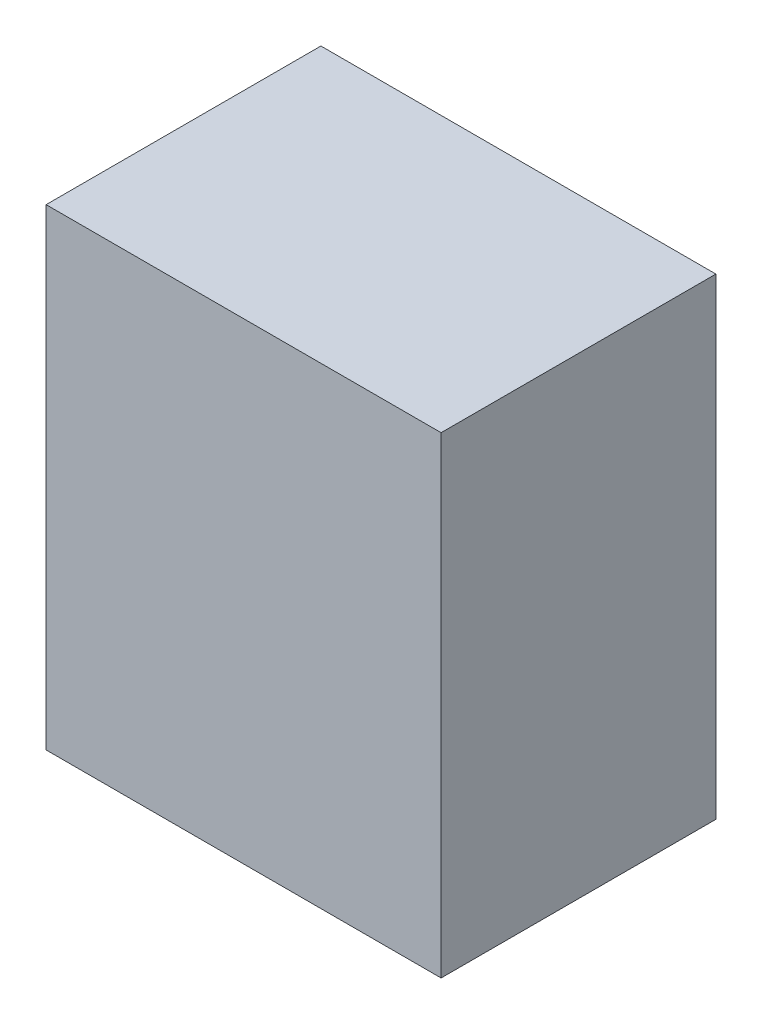
ISO-10303-21;
HEADER;
FILE_DESCRIPTION(('STEP AP214'),'2;1');
FILE_NAME('part.step','',(''),(''),'','','');
FILE_SCHEMA(('AUTOMOTIVE_DESIGN { 1 0 10303 214 1 1 1 1 }'));
ENDSEC;
DATA;
#1=APPLICATION_CONTEXT('core data for automotive mechanical design processes');
#2=APPLICATION_PROTOCOL_DEFINITION('international standard','automotive_design',2000,#1);
#3=PRODUCT_CONTEXT('',#1,'mechanical');
#4=PRODUCT('Part','Part','',(#3));
#5=PRODUCT_RELATED_PRODUCT_CATEGORY('part','',(#4));
#6=PRODUCT_DEFINITION_FORMATION('','',#4);
#7=PRODUCT_DEFINITION_CONTEXT('part definition',#1,'design');
#8=PRODUCT_DEFINITION('design','',#6,#7);
#9=PRODUCT_DEFINITION_SHAPE('','',#8);
#10=(LENGTH_UNIT() NAMED_UNIT(*) SI_UNIT(.MILLI.,.METRE.));
#11=(NAMED_UNIT(*) PLANE_ANGLE_UNIT() SI_UNIT($,.RADIAN.));
#12=(NAMED_UNIT(*) SI_UNIT($,.STERADIAN.) SOLID_ANGLE_UNIT());
#13=UNCERTAINTY_MEASURE_WITH_UNIT(LENGTH_MEASURE(1.E-05),#10,'distance_accuracy_value','');
#14=(GEOMETRIC_REPRESENTATION_CONTEXT(3) GLOBAL_UNCERTAINTY_ASSIGNED_CONTEXT((#13)) GLOBAL_UNIT_ASSIGNED_CONTEXT((#10,
#11,#12)) REPRESENTATION_CONTEXT('',''));
#15=CARTESIAN_POINT('',(0.,0.,0.));
#16=DIRECTION('',(0.,0.,1.));
#17=DIRECTION('',(1.,0.,0.));
#18=AXIS2_PLACEMENT_3D('',#15,#16,#17);
#19=CARTESIAN_POINT('',(-0.57500012,-0.68749926,0.80000094));
#20=DIRECTION('',(0.,0.,-1.));
#21=DIRECTION('',(-1.,0.,0.));
#22=AXIS2_PLACEMENT_3D('',#19,#20,#21);
#23=PLANE('',#22);
#24=DIRECTION('',(0.,1.,0.));
#25=VECTOR('',#24,1.);
#26=CARTESIAN_POINT('',(0.57500012,-0.68749926,0.80000094));
#27=LINE('',#26,#25);
#28=CARTESIAN_POINT('',(0.57500012,-0.68749926,0.80000094));
#29=VERTEX_POINT('',#28);
#30=CARTESIAN_POINT('',(0.57500012,0.6875018,0.80000094));
#31=VERTEX_POINT('',#30);
#32=EDGE_CURVE('E55',#29,#31,#27,.T.);
#33=ORIENTED_EDGE('',*,*,#32,.T.);
#34=DIRECTION('',(1.,0.,0.));
#35=VECTOR('',#34,1.);
#36=CARTESIAN_POINT('',(0.57500012,0.6875018,0.80000094));
#37=LINE('',#36,#35);
#38=CARTESIAN_POINT('',(-0.57500012,0.6875018,0.80000094));
#39=VERTEX_POINT('',#38);
#40=EDGE_CURVE('E57',#31,#39,#37,.F.);
#41=ORIENTED_EDGE('',*,*,#40,.T.);
#42=DIRECTION('',(0.,1.,0.));
#43=VECTOR('',#42,1.);
#44=CARTESIAN_POINT('',(-0.57500012,0.6875018,0.80000094));
#45=LINE('',#44,#43);
#46=CARTESIAN_POINT('',(-0.57500012,-0.68749926,0.80000094));
#47=VERTEX_POINT('',#46);
#48=EDGE_CURVE('E20',#39,#47,#45,.F.);
#49=ORIENTED_EDGE('',*,*,#48,.T.);
#50=DIRECTION('',(1.,0.,0.));
#51=VECTOR('',#50,1.);
#52=CARTESIAN_POINT('',(-0.57500012,-0.68749926,0.80000094));
#53=LINE('',#52,#51);
#54=EDGE_CURVE('E80',#47,#29,#53,.T.);
#55=ORIENTED_EDGE('',*,*,#54,.T.);
#56=EDGE_LOOP('',(#33,#41,#49,#55));
#57=FACE_BOUND('',#56,.T.);
#58=ADVANCED_FACE('F17',(#57),#23,.F.);
#59=CARTESIAN_POINT('',(-0.57500012,0.6875018,0.));
#60=DIRECTION('',(1.,0.,0.));
#61=DIRECTION('',(0.,0.,-1.));
#62=AXIS2_PLACEMENT_3D('',#59,#60,#61);
#63=PLANE('',#62);
#64=DIRECTION('',(0.,0.,1.));
#65=VECTOR('',#64,1.);
#66=CARTESIAN_POINT('',(-0.57500012,-0.68749926,0.));
#67=LINE('',#66,#65);
#68=CARTESIAN_POINT('',(-0.57500012,-0.68749926,0.));
#69=VERTEX_POINT('',#68);
#70=EDGE_CURVE('E68',#69,#47,#67,.T.);
#71=ORIENTED_EDGE('',*,*,#70,.T.);
#72=ORIENTED_EDGE('',*,*,#48,.F.);
#73=DIRECTION('',(0.,0.,-1.));
#74=VECTOR('',#73,1.);
#75=CARTESIAN_POINT('',(-0.57500012,0.6875018,0.));
#76=LINE('',#75,#74);
#77=CARTESIAN_POINT('',(-0.57500012,0.6875018,0.));
#78=VERTEX_POINT('',#77);
#79=EDGE_CURVE('E63',#39,#78,#76,.T.);
#80=ORIENTED_EDGE('',*,*,#79,.T.);
#81=DIRECTION('',(0.,1.,0.));
#82=VECTOR('',#81,1.);
#83=CARTESIAN_POINT('',(-0.57500012,-0.68749926,0.));
#84=LINE('',#83,#82);
#85=EDGE_CURVE('E83',#69,#78,#84,.T.);
#86=ORIENTED_EDGE('',*,*,#85,.F.);
#87=EDGE_LOOP('',(#71,#72,#80,#86));
#88=FACE_BOUND('',#87,.T.);
#89=ADVANCED_FACE('F65',(#88),#63,.F.);
#90=CARTESIAN_POINT('',(0.57500012,0.6875018,0.));
#91=DIRECTION('',(0.,-1.,0.));
#92=DIRECTION('',(0.,0.,-1.));
#93=AXIS2_PLACEMENT_3D('',#90,#91,#92);
#94=PLANE('',#93);
#95=ORIENTED_EDGE('',*,*,#79,.F.);
#96=ORIENTED_EDGE('',*,*,#40,.F.);
#97=DIRECTION('',(0.,0.,1.));
#98=VECTOR('',#97,1.);
#99=CARTESIAN_POINT('',(0.57500012,0.6875018,0.));
#100=LINE('',#99,#98);
#101=CARTESIAN_POINT('',(0.57500012,0.6875018,0.));
#102=VERTEX_POINT('',#101);
#103=EDGE_CURVE('E75',#31,#102,#100,.F.);
#104=ORIENTED_EDGE('',*,*,#103,.T.);
#105=DIRECTION('',(-1.,0.,0.));
#106=VECTOR('',#105,1.);
#107=CARTESIAN_POINT('',(-0.57500012,0.6875018,0.));
#108=LINE('',#107,#106);
#109=EDGE_CURVE('E72',#78,#102,#108,.F.);
#110=ORIENTED_EDGE('',*,*,#109,.F.);
#111=EDGE_LOOP('',(#95,#96,#104,#110));
#112=FACE_BOUND('',#111,.T.);
#113=ADVANCED_FACE('F70',(#112),#94,.F.);
#114=CARTESIAN_POINT('',(0.57500012,-0.68749926,0.));
#115=DIRECTION('',(-1.,0.,0.));
#116=DIRECTION('',(0.,0.,1.));
#117=AXIS2_PLACEMENT_3D('',#114,#115,#116);
#118=PLANE('',#117);
#119=ORIENTED_EDGE('',*,*,#103,.F.);
#120=ORIENTED_EDGE('',*,*,#32,.F.);
#121=DIRECTION('',(0.,0.,1.));
#122=VECTOR('',#121,1.);
#123=CARTESIAN_POINT('',(0.57500012,-0.68749926,0.));
#124=LINE('',#123,#122);
#125=CARTESIAN_POINT('',(0.57500012,-0.68749926,0.));
#126=VERTEX_POINT('',#125);
#127=EDGE_CURVE('E35',#29,#126,#124,.F.);
#128=ORIENTED_EDGE('',*,*,#127,.T.);
#129=DIRECTION('',(0.,1.,0.));
#130=VECTOR('',#129,1.);
#131=CARTESIAN_POINT('',(0.57500012,-0.68749926,0.));
#132=LINE('',#131,#130);
#133=EDGE_CURVE('E26',#102,#126,#132,.F.);
#134=ORIENTED_EDGE('',*,*,#133,.F.);
#135=EDGE_LOOP('',(#119,#120,#128,#134));
#136=FACE_BOUND('',#135,.T.);
#137=ADVANCED_FACE('F89',(#136),#118,.F.);
#138=CARTESIAN_POINT('',(-0.57500012,-0.68749926,0.));
#139=DIRECTION('',(0.,1.,0.));
#140=DIRECTION('',(0.,0.,1.));
#141=AXIS2_PLACEMENT_3D('',#138,#139,#140);
#142=PLANE('',#141);
#143=ORIENTED_EDGE('',*,*,#127,.F.);
#144=ORIENTED_EDGE('',*,*,#54,.F.);
#145=ORIENTED_EDGE('',*,*,#70,.F.);
#146=DIRECTION('',(-1.,0.,0.));
#147=VECTOR('',#146,1.);
#148=CARTESIAN_POINT('',(-0.57500012,-0.68749926,0.));
#149=LINE('',#148,#147);
#150=EDGE_CURVE('E11',#126,#69,#149,.T.);
#151=ORIENTED_EDGE('',*,*,#150,.F.);
#152=EDGE_LOOP('',(#143,#144,#145,#151));
#153=FACE_BOUND('',#152,.T.);
#154=ADVANCED_FACE('F91',(#153),#142,.F.);
#155=CARTESIAN_POINT('',(-0.57500012,-0.68749926,0.));
#156=DIRECTION('',(0.,0.,-1.));
#157=DIRECTION('',(-1.,0.,0.));
#158=AXIS2_PLACEMENT_3D('',#155,#156,#157);
#159=PLANE('',#158);
#160=ORIENTED_EDGE('',*,*,#133,.T.);
#161=ORIENTED_EDGE('',*,*,#150,.T.);
#162=ORIENTED_EDGE('',*,*,#85,.T.);
#163=ORIENTED_EDGE('',*,*,#109,.T.);
#164=EDGE_LOOP('',(#160,#161,#162,#163));
#165=FACE_BOUND('',#164,.T.);
#166=ADVANCED_FACE('F88',(#165),#159,.T.);
#167=CLOSED_SHELL('',(#58,#89,#113,#137,#154,#166));
#168=MANIFOLD_SOLID_BREP('B1',#167);
#169=ADVANCED_BREP_SHAPE_REPRESENTATION('',(#18,#168),#14);
#170=SHAPE_DEFINITION_REPRESENTATION(#9,#169);
ENDSEC;
END-ISO-10303-21;
